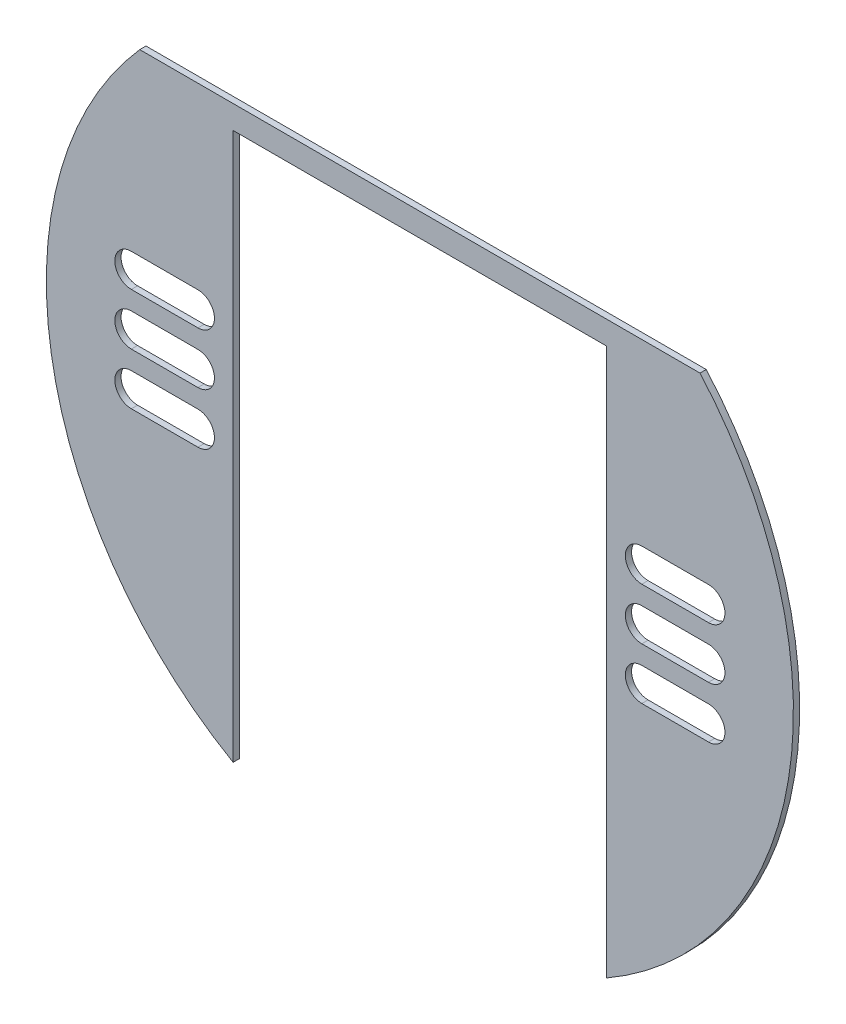
ISO-10303-21;
HEADER;
FILE_DESCRIPTION(('STEP AP214'),'2;1');
FILE_NAME('part.step','',(''),(''),'','','');
FILE_SCHEMA(('AUTOMOTIVE_DESIGN { 1 0 10303 214 1 1 1 1 }'));
ENDSEC;
DATA;
#1=APPLICATION_CONTEXT('core data for automotive mechanical design processes');
#2=APPLICATION_PROTOCOL_DEFINITION('international standard','automotive_design',2000,#1);
#3=PRODUCT_CONTEXT('',#1,'mechanical');
#4=PRODUCT('Part','Part','',(#3));
#5=PRODUCT_RELATED_PRODUCT_CATEGORY('part','',(#4));
#6=PRODUCT_DEFINITION_FORMATION('','',#4);
#7=PRODUCT_DEFINITION_CONTEXT('part definition',#1,'design');
#8=PRODUCT_DEFINITION('design','',#6,#7);
#9=PRODUCT_DEFINITION_SHAPE('','',#8);
#10=(LENGTH_UNIT() NAMED_UNIT(*) SI_UNIT(.MILLI.,.METRE.));
#11=(NAMED_UNIT(*) PLANE_ANGLE_UNIT() SI_UNIT($,.RADIAN.));
#12=(NAMED_UNIT(*) SI_UNIT($,.STERADIAN.) SOLID_ANGLE_UNIT());
#13=UNCERTAINTY_MEASURE_WITH_UNIT(LENGTH_MEASURE(1.E-05),#10,'distance_accuracy_value','');
#14=(GEOMETRIC_REPRESENTATION_CONTEXT(3) GLOBAL_UNCERTAINTY_ASSIGNED_CONTEXT((#13)) GLOBAL_UNIT_ASSIGNED_CONTEXT((#10,
#11,#12)) REPRESENTATION_CONTEXT('',''));
#15=CARTESIAN_POINT('',(0.,0.,0.));
#16=DIRECTION('',(0.,0.,1.));
#17=DIRECTION('',(1.,0.,0.));
#18=AXIS2_PLACEMENT_3D('',#15,#16,#17);
#19=CARTESIAN_POINT('',(0.,-49.0384757729337,1.));
#20=DIRECTION('',(0.,0.,-1.));
#21=DIRECTION('',(-1.,0.,0.));
#22=AXIS2_PLACEMENT_3D('',#19,#20,#21);
#23=PLANE('',#22);
#24=CARTESIAN_POINT('',(46.35,-49.0384757729337,1.));
#25=DIRECTION('',(0.,0.,1.));
#26=DIRECTION('',(1.,0.,0.));
#27=AXIS2_PLACEMENT_3D('',#24,#25,#26);
#28=CIRCLE('',#27,2.64999999999999);
#29=CARTESIAN_POINT('',(46.35,-51.6884757729337,1.));
#30=VERTEX_POINT('',#29);
#31=CARTESIAN_POINT('',(46.35,-46.3884757729337,1.));
#32=VERTEX_POINT('',#31);
#33=EDGE_CURVE('E272',#30,#32,#28,.T.);
#34=ORIENTED_EDGE('',*,*,#33,.F.);
#35=DIRECTION('',(1.,0.,0.));
#36=VECTOR('',#35,1.);
#37=CARTESIAN_POINT('',(46.35,-51.6884757729337,1.));
#38=LINE('',#37,#36);
#39=CARTESIAN_POINT('',(35.65,-51.6884757729337,1.));
#40=VERTEX_POINT('',#39);
#41=EDGE_CURVE('E280',#40,#30,#38,.T.);
#42=ORIENTED_EDGE('',*,*,#41,.F.);
#43=CARTESIAN_POINT('',(35.65,-49.0384757729337,1.));
#44=DIRECTION('',(0.,0.,1.));
#45=DIRECTION('',(1.,0.,0.));
#46=AXIS2_PLACEMENT_3D('',#43,#44,#45);
#47=CIRCLE('',#46,2.64999999999999);
#48=CARTESIAN_POINT('',(35.65,-46.3884757729337,1.));
#49=VERTEX_POINT('',#48);
#50=EDGE_CURVE('E277',#49,#40,#47,.T.);
#51=ORIENTED_EDGE('',*,*,#50,.F.);
#52=DIRECTION('',(-1.,0.,0.));
#53=VECTOR('',#52,1.);
#54=CARTESIAN_POINT('',(46.35,-46.3884757729337,1.));
#55=LINE('',#54,#53);
#56=EDGE_CURVE('E274',#32,#49,#55,.T.);
#57=ORIENTED_EDGE('',*,*,#56,.F.);
#58=EDGE_LOOP('',(#34,#42,#51,#57));
#59=FACE_BOUND('',#58,.T.);
#60=CARTESIAN_POINT('',(-35.65,-57.3384757729337,1.));
#61=DIRECTION('',(0.,0.,1.));
#62=DIRECTION('',(1.,0.,0.));
#63=AXIS2_PLACEMENT_3D('',#60,#61,#62);
#64=CIRCLE('',#63,2.65000000000001);
#65=CARTESIAN_POINT('',(-35.65,-59.9884757729337,1.));
#66=VERTEX_POINT('',#65);
#67=CARTESIAN_POINT('',(-35.65,-54.6884757729337,1.));
#68=VERTEX_POINT('',#67);
#69=EDGE_CURVE('E334',#66,#68,#64,.T.);
#70=ORIENTED_EDGE('',*,*,#69,.F.);
#71=DIRECTION('',(1.,0.,0.));
#72=VECTOR('',#71,1.);
#73=CARTESIAN_POINT('',(-35.65,-59.9884757729337,1.));
#74=LINE('',#73,#72);
#75=CARTESIAN_POINT('',(-46.35,-59.9884757729337,1.));
#76=VERTEX_POINT('',#75);
#77=EDGE_CURVE('E342',#76,#66,#74,.T.);
#78=ORIENTED_EDGE('',*,*,#77,.F.);
#79=CARTESIAN_POINT('',(-46.35,-57.3384757729337,1.));
#80=DIRECTION('',(0.,0.,1.));
#81=DIRECTION('',(1.,0.,0.));
#82=AXIS2_PLACEMENT_3D('',#79,#80,#81);
#83=CIRCLE('',#82,2.64999999999999);
#84=CARTESIAN_POINT('',(-46.35,-54.6884757729337,1.));
#85=VERTEX_POINT('',#84);
#86=EDGE_CURVE('E339',#85,#76,#83,.T.);
#87=ORIENTED_EDGE('',*,*,#86,.F.);
#88=DIRECTION('',(-1.,0.,0.));
#89=VECTOR('',#88,1.);
#90=CARTESIAN_POINT('',(-35.65,-54.6884757729337,1.));
#91=LINE('',#90,#89);
#92=EDGE_CURVE('E336',#68,#85,#91,.T.);
#93=ORIENTED_EDGE('',*,*,#92,.F.);
#94=EDGE_LOOP('',(#70,#78,#87,#93));
#95=FACE_BOUND('',#94,.T.);
#96=CARTESIAN_POINT('',(-35.65,-40.7384757729337,1.));
#97=DIRECTION('',(0.,0.,1.));
#98=DIRECTION('',(1.,0.,0.));
#99=AXIS2_PLACEMENT_3D('',#96,#97,#98);
#100=CIRCLE('',#99,2.65);
#101=CARTESIAN_POINT('',(-35.65,-43.3884757729337,1.));
#102=VERTEX_POINT('',#101);
#103=CARTESIAN_POINT('',(-35.65,-38.0884757729337,1.));
#104=VERTEX_POINT('',#103);
#105=EDGE_CURVE('E396',#102,#104,#100,.T.);
#106=ORIENTED_EDGE('',*,*,#105,.F.);
#107=DIRECTION('',(1.,0.,0.));
#108=VECTOR('',#107,1.);
#109=CARTESIAN_POINT('',(-35.65,-43.3884757729337,1.));
#110=LINE('',#109,#108);
#111=CARTESIAN_POINT('',(-46.35,-43.3884757729337,1.));
#112=VERTEX_POINT('',#111);
#113=EDGE_CURVE('E404',#112,#102,#110,.T.);
#114=ORIENTED_EDGE('',*,*,#113,.F.);
#115=CARTESIAN_POINT('',(-46.35,-40.7384757729337,1.));
#116=DIRECTION('',(0.,0.,1.));
#117=DIRECTION('',(1.,0.,0.));
#118=AXIS2_PLACEMENT_3D('',#115,#116,#117);
#119=CIRCLE('',#118,2.64999999999999);
#120=CARTESIAN_POINT('',(-46.35,-38.0884757729337,1.));
#121=VERTEX_POINT('',#120);
#122=EDGE_CURVE('E401',#121,#112,#119,.T.);
#123=ORIENTED_EDGE('',*,*,#122,.F.);
#124=DIRECTION('',(-1.,0.,0.));
#125=VECTOR('',#124,1.);
#126=CARTESIAN_POINT('',(-35.65,-38.0884757729337,1.));
#127=LINE('',#126,#125);
#128=EDGE_CURVE('E398',#104,#121,#127,.T.);
#129=ORIENTED_EDGE('',*,*,#128,.F.);
#130=EDGE_LOOP('',(#106,#114,#123,#129));
#131=FACE_BOUND('',#130,.T.);
#132=CARTESIAN_POINT('',(0.,-49.0384757729337,1.));
#133=DIRECTION('',(0.,0.,1.));
#134=DIRECTION('',(-1.,0.,0.));
#135=AXIS2_PLACEMENT_3D('',#132,#133,#134);
#136=CIRCLE('',#135,60.);
#137=CARTESIAN_POINT('',(-45.,-9.35220610696483,1.));
#138=VERTEX_POINT('',#137);
#139=CARTESIAN_POINT('',(-30.,-101.,1.));
#140=VERTEX_POINT('',#139);
#141=EDGE_CURVE('E427',#138,#140,#136,.T.);
#142=ORIENTED_EDGE('',*,*,#141,.T.);
#143=DIRECTION('',(0.,1.,0.));
#144=VECTOR('',#143,1.);
#145=CARTESIAN_POINT('',(-30.,-13.1004062070314,1.));
#146=LINE('',#145,#144);
#147=CARTESIAN_POINT('',(-30.,-13.1004062070314,1.));
#148=VERTEX_POINT('',#147);
#149=EDGE_CURVE('E430',#140,#148,#146,.T.);
#150=ORIENTED_EDGE('',*,*,#149,.T.);
#151=DIRECTION('',(1.,0.,0.));
#152=VECTOR('',#151,1.);
#153=CARTESIAN_POINT('',(-30.,-13.1004062070314,1.));
#154=LINE('',#153,#152);
#155=CARTESIAN_POINT('',(30.,-13.1004062070314,1.));
#156=VERTEX_POINT('',#155);
#157=EDGE_CURVE('E433',#148,#156,#154,.T.);
#158=ORIENTED_EDGE('',*,*,#157,.T.);
#159=DIRECTION('',(0.,-1.,0.));
#160=VECTOR('',#159,1.);
#161=CARTESIAN_POINT('',(30.,-101.,1.));
#162=LINE('',#161,#160);
#163=CARTESIAN_POINT('',(30.,-101.,1.));
#164=VERTEX_POINT('',#163);
#165=EDGE_CURVE('E435',#156,#164,#162,.T.);
#166=ORIENTED_EDGE('',*,*,#165,.T.);
#167=CARTESIAN_POINT('',(0.,-49.0384757729337,1.));
#168=DIRECTION('',(0.,0.,1.));
#169=DIRECTION('',(-1.,0.,0.));
#170=AXIS2_PLACEMENT_3D('',#167,#168,#169);
#171=CIRCLE('',#170,60.);
#172=CARTESIAN_POINT('',(45.,-9.35220610696484,1.));
#173=VERTEX_POINT('',#172);
#174=EDGE_CURVE('E437',#164,#173,#171,.T.);
#175=ORIENTED_EDGE('',*,*,#174,.T.);
#176=DIRECTION('',(-1.,0.,0.));
#177=VECTOR('',#176,1.);
#178=CARTESIAN_POINT('',(-45.,-9.35220610696483,1.));
#179=LINE('',#178,#177);
#180=EDGE_CURVE('E439',#173,#138,#179,.T.);
#181=ORIENTED_EDGE('',*,*,#180,.T.);
#182=EDGE_LOOP('',(#142,#150,#158,#166,#175,#181));
#183=FACE_BOUND('',#182,.T.);
#184=CARTESIAN_POINT('',(-35.65,-49.0384757729337,1.));
#185=DIRECTION('',(0.,0.,1.));
#186=DIRECTION('',(1.,0.,0.));
#187=AXIS2_PLACEMENT_3D('',#184,#185,#186);
#188=CIRCLE('',#187,2.64999999999999);
#189=CARTESIAN_POINT('',(-35.65,-51.6884757729337,1.));
#190=VERTEX_POINT('',#189);
#191=CARTESIAN_POINT('',(-35.65,-46.3884757729337,1.));
#192=VERTEX_POINT('',#191);
#193=EDGE_CURVE('E365',#190,#192,#188,.T.);
#194=ORIENTED_EDGE('',*,*,#193,.F.);
#195=DIRECTION('',(1.,0.,0.));
#196=VECTOR('',#195,1.);
#197=CARTESIAN_POINT('',(-35.65,-51.6884757729337,1.));
#198=LINE('',#197,#196);
#199=CARTESIAN_POINT('',(-46.35,-51.6884757729337,1.));
#200=VERTEX_POINT('',#199);
#201=EDGE_CURVE('E373',#200,#190,#198,.T.);
#202=ORIENTED_EDGE('',*,*,#201,.F.);
#203=CARTESIAN_POINT('',(-46.35,-49.0384757729337,1.));
#204=DIRECTION('',(0.,0.,1.));
#205=DIRECTION('',(1.,0.,0.));
#206=AXIS2_PLACEMENT_3D('',#203,#204,#205);
#207=CIRCLE('',#206,2.64999999999999);
#208=CARTESIAN_POINT('',(-46.35,-46.3884757729337,1.));
#209=VERTEX_POINT('',#208);
#210=EDGE_CURVE('E370',#209,#200,#207,.T.);
#211=ORIENTED_EDGE('',*,*,#210,.F.);
#212=DIRECTION('',(-1.,0.,0.));
#213=VECTOR('',#212,1.);
#214=CARTESIAN_POINT('',(-35.65,-46.3884757729337,1.));
#215=LINE('',#214,#213);
#216=EDGE_CURVE('E367',#192,#209,#215,.T.);
#217=ORIENTED_EDGE('',*,*,#216,.F.);
#218=EDGE_LOOP('',(#194,#202,#211,#217));
#219=FACE_BOUND('',#218,.T.);
#220=CARTESIAN_POINT('',(46.35,-40.7384757729337,1.));
#221=DIRECTION('',(0.,0.,1.));
#222=DIRECTION('',(1.,0.,0.));
#223=AXIS2_PLACEMENT_3D('',#220,#221,#222);
#224=CIRCLE('',#223,2.64999999999999);
#225=CARTESIAN_POINT('',(46.35,-43.3884757729337,1.));
#226=VERTEX_POINT('',#225);
#227=CARTESIAN_POINT('',(46.35,-38.0884757729337,1.));
#228=VERTEX_POINT('',#227);
#229=EDGE_CURVE('E303',#226,#228,#224,.T.);
#230=ORIENTED_EDGE('',*,*,#229,.F.);
#231=DIRECTION('',(1.,0.,0.));
#232=VECTOR('',#231,1.);
#233=CARTESIAN_POINT('',(46.35,-43.3884757729337,1.));
#234=LINE('',#233,#232);
#235=CARTESIAN_POINT('',(35.65,-43.3884757729337,1.));
#236=VERTEX_POINT('',#235);
#237=EDGE_CURVE('E311',#236,#226,#234,.T.);
#238=ORIENTED_EDGE('',*,*,#237,.F.);
#239=CARTESIAN_POINT('',(35.65,-40.7384757729337,1.));
#240=DIRECTION('',(0.,0.,1.));
#241=DIRECTION('',(1.,0.,0.));
#242=AXIS2_PLACEMENT_3D('',#239,#240,#241);
#243=CIRCLE('',#242,2.64999999999999);
#244=CARTESIAN_POINT('',(35.65,-38.0884757729337,1.));
#245=VERTEX_POINT('',#244);
#246=EDGE_CURVE('E308',#245,#236,#243,.T.);
#247=ORIENTED_EDGE('',*,*,#246,.F.);
#248=DIRECTION('',(-1.,0.,0.));
#249=VECTOR('',#248,1.);
#250=CARTESIAN_POINT('',(46.35,-38.0884757729337,1.));
#251=LINE('',#250,#249);
#252=EDGE_CURVE('E305',#228,#245,#251,.T.);
#253=ORIENTED_EDGE('',*,*,#252,.F.);
#254=EDGE_LOOP('',(#230,#238,#247,#253));
#255=FACE_BOUND('',#254,.T.);
#256=CARTESIAN_POINT('',(46.35,-57.3384757729337,1.));
#257=DIRECTION('',(0.,0.,1.));
#258=DIRECTION('',(1.,0.,0.));
#259=AXIS2_PLACEMENT_3D('',#256,#257,#258);
#260=CIRCLE('',#259,2.65);
#261=CARTESIAN_POINT('',(46.35,-59.9884757729337,1.));
#262=VERTEX_POINT('',#261);
#263=CARTESIAN_POINT('',(46.35,-54.6884757729337,1.));
#264=VERTEX_POINT('',#263);
#265=EDGE_CURVE('E236',#262,#264,#260,.T.);
#266=ORIENTED_EDGE('',*,*,#265,.F.);
#267=DIRECTION('',(1.,0.,0.));
#268=VECTOR('',#267,1.);
#269=CARTESIAN_POINT('',(46.35,-59.9884757729337,1.));
#270=LINE('',#269,#268);
#271=CARTESIAN_POINT('',(35.65,-59.9884757729337,1.));
#272=VERTEX_POINT('',#271);
#273=EDGE_CURVE('E258',#272,#262,#270,.T.);
#274=ORIENTED_EDGE('',*,*,#273,.F.);
#275=CARTESIAN_POINT('',(35.65,-57.3384757729337,1.));
#276=DIRECTION('',(0.,0.,1.));
#277=DIRECTION('',(1.,0.,0.));
#278=AXIS2_PLACEMENT_3D('',#275,#276,#277);
#279=CIRCLE('',#278,2.65000000000001);
#280=CARTESIAN_POINT('',(35.65,-54.6884757729337,1.));
#281=VERTEX_POINT('',#280);
#282=EDGE_CURVE('E256',#281,#272,#279,.T.);
#283=ORIENTED_EDGE('',*,*,#282,.F.);
#284=DIRECTION('',(-1.,0.,0.));
#285=VECTOR('',#284,1.);
#286=CARTESIAN_POINT('',(46.35,-54.6884757729337,1.));
#287=LINE('',#286,#285);
#288=EDGE_CURVE('E244',#264,#281,#287,.T.);
#289=ORIENTED_EDGE('',*,*,#288,.F.);
#290=EDGE_LOOP('',(#266,#274,#283,#289));
#291=FACE_BOUND('',#290,.T.);
#292=ADVANCED_FACE('F39',(#59,#95,#131,#183,#219,#255,#291),#23,.F.);
#293=CARTESIAN_POINT('',(0.,-49.0384757729337,0.));
#294=DIRECTION('',(0.,0.,-1.));
#295=DIRECTION('',(-1.,0.,0.));
#296=AXIS2_PLACEMENT_3D('',#293,#294,#295);
#297=PLANE('',#296);
#298=CARTESIAN_POINT('',(0.,-49.0384757729337,0.));
#299=DIRECTION('',(0.,0.,1.));
#300=DIRECTION('',(-1.,0.,0.));
#301=AXIS2_PLACEMENT_3D('',#298,#299,#300);
#302=CIRCLE('',#301,60.);
#303=CARTESIAN_POINT('',(-45.,-9.35220610696483,0.));
#304=VERTEX_POINT('',#303);
#305=CARTESIAN_POINT('',(-30.,-101.,0.));
#306=VERTEX_POINT('',#305);
#307=EDGE_CURVE('E426',#304,#306,#302,.T.);
#308=ORIENTED_EDGE('',*,*,#307,.F.);
#309=DIRECTION('',(-1.,0.,0.));
#310=VECTOR('',#309,1.);
#311=CARTESIAN_POINT('',(-45.,-9.35220610696483,0.));
#312=LINE('',#311,#310);
#313=CARTESIAN_POINT('',(45.,-9.35220610696484,0.));
#314=VERTEX_POINT('',#313);
#315=EDGE_CURVE('E431',#314,#304,#312,.T.);
#316=ORIENTED_EDGE('',*,*,#315,.F.);
#317=CARTESIAN_POINT('',(0.,-49.0384757729337,0.));
#318=DIRECTION('',(0.,0.,1.));
#319=DIRECTION('',(-1.,0.,0.));
#320=AXIS2_PLACEMENT_3D('',#317,#318,#319);
#321=CIRCLE('',#320,60.);
#322=CARTESIAN_POINT('',(30.,-101.,0.));
#323=VERTEX_POINT('',#322);
#324=EDGE_CURVE('E450',#323,#314,#321,.T.);
#325=ORIENTED_EDGE('',*,*,#324,.F.);
#326=DIRECTION('',(0.,-1.,0.));
#327=VECTOR('',#326,1.);
#328=CARTESIAN_POINT('',(30.,-101.,0.));
#329=LINE('',#328,#327);
#330=CARTESIAN_POINT('',(30.,-13.1004062070314,0.));
#331=VERTEX_POINT('',#330);
#332=EDGE_CURVE('E448',#331,#323,#329,.T.);
#333=ORIENTED_EDGE('',*,*,#332,.F.);
#334=DIRECTION('',(1.,0.,0.));
#335=VECTOR('',#334,1.);
#336=CARTESIAN_POINT('',(-30.,-13.1004062070314,0.));
#337=LINE('',#336,#335);
#338=CARTESIAN_POINT('',(-30.,-13.1004062070314,0.));
#339=VERTEX_POINT('',#338);
#340=EDGE_CURVE('E446',#339,#331,#337,.T.);
#341=ORIENTED_EDGE('',*,*,#340,.F.);
#342=DIRECTION('',(0.,1.,0.));
#343=VECTOR('',#342,1.);
#344=CARTESIAN_POINT('',(-30.,-13.1004062070314,0.));
#345=LINE('',#344,#343);
#346=EDGE_CURVE('E444',#306,#339,#345,.T.);
#347=ORIENTED_EDGE('',*,*,#346,.F.);
#348=EDGE_LOOP('',(#308,#316,#325,#333,#341,#347));
#349=FACE_BOUND('',#348,.T.);
#350=DIRECTION('',(1.,0.,0.));
#351=VECTOR('',#350,1.);
#352=CARTESIAN_POINT('',(-35.65,-43.3884757729337,0.));
#353=LINE('',#352,#351);
#354=CARTESIAN_POINT('',(-46.35,-43.3884757729337,0.));
#355=VERTEX_POINT('',#354);
#356=CARTESIAN_POINT('',(-35.65,-43.3884757729337,0.));
#357=VERTEX_POINT('',#356);
#358=EDGE_CURVE('E399',#355,#357,#353,.T.);
#359=ORIENTED_EDGE('',*,*,#358,.T.);
#360=CARTESIAN_POINT('',(-35.65,-40.7384757729337,0.));
#361=DIRECTION('',(0.,0.,1.));
#362=DIRECTION('',(1.,0.,0.));
#363=AXIS2_PLACEMENT_3D('',#360,#361,#362);
#364=CIRCLE('',#363,2.65);
#365=CARTESIAN_POINT('',(-35.65,-38.0884757729337,0.));
#366=VERTEX_POINT('',#365);
#367=EDGE_CURVE('E395',#357,#366,#364,.T.);
#368=ORIENTED_EDGE('',*,*,#367,.T.);
#369=DIRECTION('',(-1.,0.,0.));
#370=VECTOR('',#369,1.);
#371=CARTESIAN_POINT('',(-35.65,-38.0884757729337,0.));
#372=LINE('',#371,#370);
#373=CARTESIAN_POINT('',(-46.35,-38.0884757729337,0.));
#374=VERTEX_POINT('',#373);
#375=EDGE_CURVE('E409',#366,#374,#372,.T.);
#376=ORIENTED_EDGE('',*,*,#375,.T.);
#377=CARTESIAN_POINT('',(-46.35,-40.7384757729337,0.));
#378=DIRECTION('',(0.,0.,1.));
#379=DIRECTION('',(1.,0.,0.));
#380=AXIS2_PLACEMENT_3D('',#377,#378,#379);
#381=CIRCLE('',#380,2.64999999999999);
#382=EDGE_CURVE('E412',#374,#355,#381,.T.);
#383=ORIENTED_EDGE('',*,*,#382,.T.);
#384=EDGE_LOOP('',(#359,#368,#376,#383));
#385=FACE_BOUND('',#384,.T.);
#386=DIRECTION('',(1.,0.,0.));
#387=VECTOR('',#386,1.);
#388=CARTESIAN_POINT('',(-35.65,-51.6884757729337,0.));
#389=LINE('',#388,#387);
#390=CARTESIAN_POINT('',(-46.35,-51.6884757729337,0.));
#391=VERTEX_POINT('',#390);
#392=CARTESIAN_POINT('',(-35.65,-51.6884757729337,0.));
#393=VERTEX_POINT('',#392);
#394=EDGE_CURVE('E368',#391,#393,#389,.T.);
#395=ORIENTED_EDGE('',*,*,#394,.T.);
#396=CARTESIAN_POINT('',(-35.65,-49.0384757729337,0.));
#397=DIRECTION('',(0.,0.,1.));
#398=DIRECTION('',(1.,0.,0.));
#399=AXIS2_PLACEMENT_3D('',#396,#397,#398);
#400=CIRCLE('',#399,2.64999999999999);
#401=CARTESIAN_POINT('',(-35.65,-46.3884757729337,0.));
#402=VERTEX_POINT('',#401);
#403=EDGE_CURVE('E364',#393,#402,#400,.T.);
#404=ORIENTED_EDGE('',*,*,#403,.T.);
#405=DIRECTION('',(-1.,0.,0.));
#406=VECTOR('',#405,1.);
#407=CARTESIAN_POINT('',(-35.65,-46.3884757729337,0.));
#408=LINE('',#407,#406);
#409=CARTESIAN_POINT('',(-46.35,-46.3884757729337,0.));
#410=VERTEX_POINT('',#409);
#411=EDGE_CURVE('E378',#402,#410,#408,.T.);
#412=ORIENTED_EDGE('',*,*,#411,.T.);
#413=CARTESIAN_POINT('',(-46.35,-49.0384757729337,0.));
#414=DIRECTION('',(0.,0.,1.));
#415=DIRECTION('',(1.,0.,0.));
#416=AXIS2_PLACEMENT_3D('',#413,#414,#415);
#417=CIRCLE('',#416,2.64999999999999);
#418=EDGE_CURVE('E381',#410,#391,#417,.T.);
#419=ORIENTED_EDGE('',*,*,#418,.T.);
#420=EDGE_LOOP('',(#395,#404,#412,#419));
#421=FACE_BOUND('',#420,.T.);
#422=DIRECTION('',(1.,0.,0.));
#423=VECTOR('',#422,1.);
#424=CARTESIAN_POINT('',(-35.65,-59.9884757729337,0.));
#425=LINE('',#424,#423);
#426=CARTESIAN_POINT('',(-46.35,-59.9884757729337,0.));
#427=VERTEX_POINT('',#426);
#428=CARTESIAN_POINT('',(-35.65,-59.9884757729337,0.));
#429=VERTEX_POINT('',#428);
#430=EDGE_CURVE('E337',#427,#429,#425,.T.);
#431=ORIENTED_EDGE('',*,*,#430,.T.);
#432=CARTESIAN_POINT('',(-35.65,-57.3384757729337,0.));
#433=DIRECTION('',(0.,0.,1.));
#434=DIRECTION('',(1.,0.,0.));
#435=AXIS2_PLACEMENT_3D('',#432,#433,#434);
#436=CIRCLE('',#435,2.65000000000001);
#437=CARTESIAN_POINT('',(-35.65,-54.6884757729337,0.));
#438=VERTEX_POINT('',#437);
#439=EDGE_CURVE('E333',#429,#438,#436,.T.);
#440=ORIENTED_EDGE('',*,*,#439,.T.);
#441=DIRECTION('',(-1.,0.,0.));
#442=VECTOR('',#441,1.);
#443=CARTESIAN_POINT('',(-35.65,-54.6884757729337,0.));
#444=LINE('',#443,#442);
#445=CARTESIAN_POINT('',(-46.35,-54.6884757729337,0.));
#446=VERTEX_POINT('',#445);
#447=EDGE_CURVE('E347',#438,#446,#444,.T.);
#448=ORIENTED_EDGE('',*,*,#447,.T.);
#449=CARTESIAN_POINT('',(-46.35,-57.3384757729337,0.));
#450=DIRECTION('',(0.,0.,1.));
#451=DIRECTION('',(1.,0.,0.));
#452=AXIS2_PLACEMENT_3D('',#449,#450,#451);
#453=CIRCLE('',#452,2.64999999999999);
#454=EDGE_CURVE('E350',#446,#427,#453,.T.);
#455=ORIENTED_EDGE('',*,*,#454,.T.);
#456=EDGE_LOOP('',(#431,#440,#448,#455));
#457=FACE_BOUND('',#456,.T.);
#458=DIRECTION('',(1.,0.,0.));
#459=VECTOR('',#458,1.);
#460=CARTESIAN_POINT('',(46.35,-43.3884757729337,0.));
#461=LINE('',#460,#459);
#462=CARTESIAN_POINT('',(35.65,-43.3884757729337,0.));
#463=VERTEX_POINT('',#462);
#464=CARTESIAN_POINT('',(46.35,-43.3884757729337,0.));
#465=VERTEX_POINT('',#464);
#466=EDGE_CURVE('E306',#463,#465,#461,.T.);
#467=ORIENTED_EDGE('',*,*,#466,.T.);
#468=CARTESIAN_POINT('',(46.35,-40.7384757729337,0.));
#469=DIRECTION('',(0.,0.,1.));
#470=DIRECTION('',(1.,0.,0.));
#471=AXIS2_PLACEMENT_3D('',#468,#469,#470);
#472=CIRCLE('',#471,2.64999999999999);
#473=CARTESIAN_POINT('',(46.35,-38.0884757729337,0.));
#474=VERTEX_POINT('',#473);
#475=EDGE_CURVE('E302',#465,#474,#472,.T.);
#476=ORIENTED_EDGE('',*,*,#475,.T.);
#477=DIRECTION('',(-1.,0.,0.));
#478=VECTOR('',#477,1.);
#479=CARTESIAN_POINT('',(46.35,-38.0884757729337,0.));
#480=LINE('',#479,#478);
#481=CARTESIAN_POINT('',(35.65,-38.0884757729337,0.));
#482=VERTEX_POINT('',#481);
#483=EDGE_CURVE('E316',#474,#482,#480,.T.);
#484=ORIENTED_EDGE('',*,*,#483,.T.);
#485=CARTESIAN_POINT('',(35.65,-40.7384757729337,0.));
#486=DIRECTION('',(0.,0.,1.));
#487=DIRECTION('',(1.,0.,0.));
#488=AXIS2_PLACEMENT_3D('',#485,#486,#487);
#489=CIRCLE('',#488,2.64999999999999);
#490=EDGE_CURVE('E319',#482,#463,#489,.T.);
#491=ORIENTED_EDGE('',*,*,#490,.T.);
#492=EDGE_LOOP('',(#467,#476,#484,#491));
#493=FACE_BOUND('',#492,.T.);
#494=DIRECTION('',(1.,0.,0.));
#495=VECTOR('',#494,1.);
#496=CARTESIAN_POINT('',(46.35,-51.6884757729337,0.));
#497=LINE('',#496,#495);
#498=CARTESIAN_POINT('',(35.65,-51.6884757729337,0.));
#499=VERTEX_POINT('',#498);
#500=CARTESIAN_POINT('',(46.35,-51.6884757729337,0.));
#501=VERTEX_POINT('',#500);
#502=EDGE_CURVE('E275',#499,#501,#497,.T.);
#503=ORIENTED_EDGE('',*,*,#502,.T.);
#504=CARTESIAN_POINT('',(46.35,-49.0384757729337,0.));
#505=DIRECTION('',(0.,0.,1.));
#506=DIRECTION('',(1.,0.,0.));
#507=AXIS2_PLACEMENT_3D('',#504,#505,#506);
#508=CIRCLE('',#507,2.64999999999999);
#509=CARTESIAN_POINT('',(46.35,-46.3884757729337,0.));
#510=VERTEX_POINT('',#509);
#511=EDGE_CURVE('E252',#501,#510,#508,.T.);
#512=ORIENTED_EDGE('',*,*,#511,.T.);
#513=DIRECTION('',(-1.,0.,0.));
#514=VECTOR('',#513,1.);
#515=CARTESIAN_POINT('',(46.35,-46.3884757729337,0.));
#516=LINE('',#515,#514);
#517=CARTESIAN_POINT('',(35.65,-46.3884757729337,0.));
#518=VERTEX_POINT('',#517);
#519=EDGE_CURVE('E285',#510,#518,#516,.T.);
#520=ORIENTED_EDGE('',*,*,#519,.T.);
#521=CARTESIAN_POINT('',(35.65,-49.0384757729337,0.));
#522=DIRECTION('',(0.,0.,1.));
#523=DIRECTION('',(1.,0.,0.));
#524=AXIS2_PLACEMENT_3D('',#521,#522,#523);
#525=CIRCLE('',#524,2.64999999999999);
#526=EDGE_CURVE('E288',#518,#499,#525,.T.);
#527=ORIENTED_EDGE('',*,*,#526,.T.);
#528=EDGE_LOOP('',(#503,#512,#520,#527));
#529=FACE_BOUND('',#528,.T.);
#530=DIRECTION('',(1.,0.,0.));
#531=VECTOR('',#530,1.);
#532=CARTESIAN_POINT('',(46.35,-59.9884757729337,0.));
#533=LINE('',#532,#531);
#534=CARTESIAN_POINT('',(35.65,-59.9884757729337,0.));
#535=VERTEX_POINT('',#534);
#536=CARTESIAN_POINT('',(46.35,-59.9884757729337,0.));
#537=VERTEX_POINT('',#536);
#538=EDGE_CURVE('E245',#535,#537,#533,.T.);
#539=ORIENTED_EDGE('',*,*,#538,.T.);
#540=CARTESIAN_POINT('',(46.35,-57.3384757729337,0.));
#541=DIRECTION('',(0.,0.,1.));
#542=DIRECTION('',(1.,0.,0.));
#543=AXIS2_PLACEMENT_3D('',#540,#541,#542);
#544=CIRCLE('',#543,2.65);
#545=CARTESIAN_POINT('',(46.35,-54.6884757729337,0.));
#546=VERTEX_POINT('',#545);
#547=EDGE_CURVE('E62',#537,#546,#544,.T.);
#548=ORIENTED_EDGE('',*,*,#547,.T.);
#549=DIRECTION('',(-1.,0.,0.));
#550=VECTOR('',#549,1.);
#551=CARTESIAN_POINT('',(46.35,-54.6884757729337,0.));
#552=LINE('',#551,#550);
#553=CARTESIAN_POINT('',(35.65,-54.6884757729337,0.));
#554=VERTEX_POINT('',#553);
#555=EDGE_CURVE('E251',#546,#554,#552,.T.);
#556=ORIENTED_EDGE('',*,*,#555,.T.);
#557=CARTESIAN_POINT('',(35.65,-57.3384757729337,0.));
#558=DIRECTION('',(0.,0.,1.));
#559=DIRECTION('',(1.,0.,0.));
#560=AXIS2_PLACEMENT_3D('',#557,#558,#559);
#561=CIRCLE('',#560,2.65000000000001);
#562=EDGE_CURVE('E264',#554,#535,#561,.T.);
#563=ORIENTED_EDGE('',*,*,#562,.T.);
#564=EDGE_LOOP('',(#539,#548,#556,#563));
#565=FACE_BOUND('',#564,.T.);
#566=ADVANCED_FACE('F474',(#349,#385,#421,#457,#493,#529,#565),#297,.T.);
#567=CARTESIAN_POINT('',(0.,-49.0384757729337,1.));
#568=DIRECTION('',(0.,0.,-1.));
#569=DIRECTION('',(-1.,0.,0.));
#570=AXIS2_PLACEMENT_3D('',#567,#568,#569);
#571=CYLINDRICAL_SURFACE('',#570,60.);
#572=ORIENTED_EDGE('',*,*,#307,.T.);
#573=DIRECTION('',(0.,0.,-1.));
#574=VECTOR('',#573,1.);
#575=CARTESIAN_POINT('',(-30.,-101.,1.));
#576=LINE('',#575,#574);
#577=EDGE_CURVE('E11',#140,#306,#576,.T.);
#578=ORIENTED_EDGE('',*,*,#577,.F.);
#579=ORIENTED_EDGE('',*,*,#141,.F.);
#580=DIRECTION('',(0.,0.,-1.));
#581=VECTOR('',#580,1.);
#582=CARTESIAN_POINT('',(-45.,-9.35220610696483,1.));
#583=LINE('',#582,#581);
#584=EDGE_CURVE('E441',#138,#304,#583,.T.);
#585=ORIENTED_EDGE('',*,*,#584,.T.);
#586=EDGE_LOOP('',(#572,#578,#579,#585));
#587=FACE_BOUND('',#586,.T.);
#588=ADVANCED_FACE('F41',(#587),#571,.T.);
#589=CARTESIAN_POINT('',(-30.,-13.1004062070314,1.));
#590=DIRECTION('',(-1.,0.,0.));
#591=DIRECTION('',(0.,-1.,0.));
#592=AXIS2_PLACEMENT_3D('',#589,#590,#591);
#593=PLANE('',#592);
#594=ORIENTED_EDGE('',*,*,#346,.T.);
#595=DIRECTION('',(0.,0.,-1.));
#596=VECTOR('',#595,1.);
#597=CARTESIAN_POINT('',(-30.,-13.1004062070314,1.));
#598=LINE('',#597,#596);
#599=EDGE_CURVE('E47',#148,#339,#598,.T.);
#600=ORIENTED_EDGE('',*,*,#599,.F.);
#601=ORIENTED_EDGE('',*,*,#149,.F.);
#602=ORIENTED_EDGE('',*,*,#577,.T.);
#603=EDGE_LOOP('',(#594,#600,#601,#602));
#604=FACE_BOUND('',#603,.T.);
#605=ADVANCED_FACE('F492',(#604),#593,.F.);
#606=CARTESIAN_POINT('',(-30.,-13.1004062070314,1.));
#607=DIRECTION('',(0.,1.,0.));
#608=DIRECTION('',(0.,0.,1.));
#609=AXIS2_PLACEMENT_3D('',#606,#607,#608);
#610=PLANE('',#609);
#611=ORIENTED_EDGE('',*,*,#340,.T.);
#612=DIRECTION('',(0.,0.,-1.));
#613=VECTOR('',#612,1.);
#614=CARTESIAN_POINT('',(30.,-13.1004062070314,1.));
#615=LINE('',#614,#613);
#616=EDGE_CURVE('E461',#156,#331,#615,.T.);
#617=ORIENTED_EDGE('',*,*,#616,.F.);
#618=ORIENTED_EDGE('',*,*,#157,.F.);
#619=ORIENTED_EDGE('',*,*,#599,.T.);
#620=EDGE_LOOP('',(#611,#617,#618,#619));
#621=FACE_BOUND('',#620,.T.);
#622=ADVANCED_FACE('F468',(#621),#610,.F.);
#623=CARTESIAN_POINT('',(30.,-101.,1.));
#624=DIRECTION('',(1.,0.,0.));
#625=DIRECTION('',(0.,1.,0.));
#626=AXIS2_PLACEMENT_3D('',#623,#624,#625);
#627=PLANE('',#626);
#628=ORIENTED_EDGE('',*,*,#332,.T.);
#629=DIRECTION('',(0.,0.,-1.));
#630=VECTOR('',#629,1.);
#631=CARTESIAN_POINT('',(30.,-101.,1.));
#632=LINE('',#631,#630);
#633=EDGE_CURVE('E458',#164,#323,#632,.T.);
#634=ORIENTED_EDGE('',*,*,#633,.F.);
#635=ORIENTED_EDGE('',*,*,#165,.F.);
#636=ORIENTED_EDGE('',*,*,#616,.T.);
#637=EDGE_LOOP('',(#628,#634,#635,#636));
#638=FACE_BOUND('',#637,.T.);
#639=ADVANCED_FACE('F480',(#638),#627,.F.);
#640=CARTESIAN_POINT('',(0.,-49.0384757729337,1.));
#641=DIRECTION('',(0.,0.,-1.));
#642=DIRECTION('',(-1.,0.,0.));
#643=AXIS2_PLACEMENT_3D('',#640,#641,#642);
#644=CYLINDRICAL_SURFACE('',#643,60.);
#645=ORIENTED_EDGE('',*,*,#324,.T.);
#646=DIRECTION('',(0.,0.,-1.));
#647=VECTOR('',#646,1.);
#648=CARTESIAN_POINT('',(45.,-9.35220610696484,1.));
#649=LINE('',#648,#647);
#650=EDGE_CURVE('E455',#173,#314,#649,.T.);
#651=ORIENTED_EDGE('',*,*,#650,.F.);
#652=ORIENTED_EDGE('',*,*,#174,.F.);
#653=ORIENTED_EDGE('',*,*,#633,.T.);
#654=EDGE_LOOP('',(#645,#651,#652,#653));
#655=FACE_BOUND('',#654,.T.);
#656=ADVANCED_FACE('F484',(#655),#644,.T.);
#657=CARTESIAN_POINT('',(-45.,-9.35220610696483,1.));
#658=DIRECTION('',(0.,-1.,0.));
#659=DIRECTION('',(0.,0.,-1.));
#660=AXIS2_PLACEMENT_3D('',#657,#658,#659);
#661=PLANE('',#660);
#662=ORIENTED_EDGE('',*,*,#315,.T.);
#663=ORIENTED_EDGE('',*,*,#584,.F.);
#664=ORIENTED_EDGE('',*,*,#180,.F.);
#665=ORIENTED_EDGE('',*,*,#650,.T.);
#666=EDGE_LOOP('',(#662,#663,#664,#665));
#667=FACE_BOUND('',#666,.T.);
#668=ADVANCED_FACE('F495',(#667),#661,.F.);
#669=CARTESIAN_POINT('',(-35.65,-40.7384757729337,1.));
#670=DIRECTION('',(0.,0.,-1.));
#671=DIRECTION('',(-1.,0.,0.));
#672=AXIS2_PLACEMENT_3D('',#669,#670,#671);
#673=CYLINDRICAL_SURFACE('',#672,2.65);
#674=ORIENTED_EDGE('',*,*,#367,.F.);
#675=DIRECTION('',(0.,0.,-1.));
#676=VECTOR('',#675,1.);
#677=CARTESIAN_POINT('',(-35.65,-43.3884757729337,1.));
#678=LINE('',#677,#676);
#679=EDGE_CURVE('E406',#102,#357,#678,.T.);
#680=ORIENTED_EDGE('',*,*,#679,.F.);
#681=ORIENTED_EDGE('',*,*,#105,.T.);
#682=DIRECTION('',(0.,0.,-1.));
#683=VECTOR('',#682,1.);
#684=CARTESIAN_POINT('',(-35.65,-38.0884757729337,1.));
#685=LINE('',#684,#683);
#686=EDGE_CURVE('E423',#104,#366,#685,.T.);
#687=ORIENTED_EDGE('',*,*,#686,.T.);
#688=EDGE_LOOP('',(#674,#680,#681,#687));
#689=FACE_BOUND('',#688,.T.);
#690=ADVANCED_FACE('F497',(#689),#673,.F.);
#691=CARTESIAN_POINT('',(-35.65,-38.0884757729337,1.));
#692=DIRECTION('',(0.,-1.,0.));
#693=DIRECTION('',(1.,0.,0.));
#694=AXIS2_PLACEMENT_3D('',#691,#692,#693);
#695=PLANE('',#694);
#696=ORIENTED_EDGE('',*,*,#375,.F.);
#697=ORIENTED_EDGE('',*,*,#686,.F.);
#698=ORIENTED_EDGE('',*,*,#128,.T.);
#699=DIRECTION('',(0.,0.,-1.));
#700=VECTOR('',#699,1.);
#701=CARTESIAN_POINT('',(-46.35,-38.0884757729337,1.));
#702=LINE('',#701,#700);
#703=EDGE_CURVE('E421',#121,#374,#702,.T.);
#704=ORIENTED_EDGE('',*,*,#703,.T.);
#705=EDGE_LOOP('',(#696,#697,#698,#704));
#706=FACE_BOUND('',#705,.T.);
#707=ADVANCED_FACE('F503',(#706),#695,.T.);
#708=CARTESIAN_POINT('',(-46.35,-40.7384757729337,1.));
#709=DIRECTION('',(0.,0.,-1.));
#710=DIRECTION('',(-1.,0.,0.));
#711=AXIS2_PLACEMENT_3D('',#708,#709,#710);
#712=CYLINDRICAL_SURFACE('',#711,2.64999999999999);
#713=ORIENTED_EDGE('',*,*,#382,.F.);
#714=ORIENTED_EDGE('',*,*,#703,.F.);
#715=ORIENTED_EDGE('',*,*,#122,.T.);
#716=DIRECTION('',(0.,0.,-1.));
#717=VECTOR('',#716,1.);
#718=CARTESIAN_POINT('',(-46.35,-43.3884757729337,1.));
#719=LINE('',#718,#717);
#720=EDGE_CURVE('E419',#112,#355,#719,.T.);
#721=ORIENTED_EDGE('',*,*,#720,.T.);
#722=EDGE_LOOP('',(#713,#714,#715,#721));
#723=FACE_BOUND('',#722,.T.);
#724=ADVANCED_FACE('F519',(#723),#712,.F.);
#725=CARTESIAN_POINT('',(-35.65,-43.3884757729337,1.));
#726=DIRECTION('',(0.,1.,0.));
#727=DIRECTION('',(-1.,0.,0.));
#728=AXIS2_PLACEMENT_3D('',#725,#726,#727);
#729=PLANE('',#728);
#730=ORIENTED_EDGE('',*,*,#358,.F.);
#731=ORIENTED_EDGE('',*,*,#720,.F.);
#732=ORIENTED_EDGE('',*,*,#113,.T.);
#733=ORIENTED_EDGE('',*,*,#679,.T.);
#734=EDGE_LOOP('',(#730,#731,#732,#733));
#735=FACE_BOUND('',#734,.T.);
#736=ADVANCED_FACE('F523',(#735),#729,.T.);
#737=CARTESIAN_POINT('',(-35.65,-49.0384757729337,1.));
#738=DIRECTION('',(0.,0.,-1.));
#739=DIRECTION('',(-1.,0.,0.));
#740=AXIS2_PLACEMENT_3D('',#737,#738,#739);
#741=CYLINDRICAL_SURFACE('',#740,2.64999999999999);
#742=ORIENTED_EDGE('',*,*,#403,.F.);
#743=DIRECTION('',(0.,0.,-1.));
#744=VECTOR('',#743,1.);
#745=CARTESIAN_POINT('',(-35.65,-51.6884757729337,1.));
#746=LINE('',#745,#744);
#747=EDGE_CURVE('E375',#190,#393,#746,.T.);
#748=ORIENTED_EDGE('',*,*,#747,.F.);
#749=ORIENTED_EDGE('',*,*,#193,.T.);
#750=DIRECTION('',(0.,0.,-1.));
#751=VECTOR('',#750,1.);
#752=CARTESIAN_POINT('',(-35.65,-46.3884757729337,1.));
#753=LINE('',#752,#751);
#754=EDGE_CURVE('E392',#192,#402,#753,.T.);
#755=ORIENTED_EDGE('',*,*,#754,.T.);
#756=EDGE_LOOP('',(#742,#748,#749,#755));
#757=FACE_BOUND('',#756,.T.);
#758=ADVANCED_FACE('F527',(#757),#741,.F.);
#759=CARTESIAN_POINT('',(-35.65,-46.3884757729337,1.));
#760=DIRECTION('',(0.,-1.,0.));
#761=DIRECTION('',(0.,0.,-1.));
#762=AXIS2_PLACEMENT_3D('',#759,#760,#761);
#763=PLANE('',#762);
#764=ORIENTED_EDGE('',*,*,#411,.F.);
#765=ORIENTED_EDGE('',*,*,#754,.F.);
#766=ORIENTED_EDGE('',*,*,#216,.T.);
#767=DIRECTION('',(0.,0.,-1.));
#768=VECTOR('',#767,1.);
#769=CARTESIAN_POINT('',(-46.35,-46.3884757729337,1.));
#770=LINE('',#769,#768);
#771=EDGE_CURVE('E390',#209,#410,#770,.T.);
#772=ORIENTED_EDGE('',*,*,#771,.T.);
#773=EDGE_LOOP('',(#764,#765,#766,#772));
#774=FACE_BOUND('',#773,.T.);
#775=ADVANCED_FACE('F531',(#774),#763,.T.);
#776=CARTESIAN_POINT('',(-46.35,-49.0384757729337,1.));
#777=DIRECTION('',(0.,0.,-1.));
#778=DIRECTION('',(-1.,0.,0.));
#779=AXIS2_PLACEMENT_3D('',#776,#777,#778);
#780=CYLINDRICAL_SURFACE('',#779,2.64999999999999);
#781=ORIENTED_EDGE('',*,*,#418,.F.);
#782=ORIENTED_EDGE('',*,*,#771,.F.);
#783=ORIENTED_EDGE('',*,*,#210,.T.);
#784=DIRECTION('',(0.,0.,-1.));
#785=VECTOR('',#784,1.);
#786=CARTESIAN_POINT('',(-46.35,-51.6884757729337,1.));
#787=LINE('',#786,#785);
#788=EDGE_CURVE('E388',#200,#391,#787,.T.);
#789=ORIENTED_EDGE('',*,*,#788,.T.);
#790=EDGE_LOOP('',(#781,#782,#783,#789));
#791=FACE_BOUND('',#790,.T.);
#792=ADVANCED_FACE('F535',(#791),#780,.F.);
#793=CARTESIAN_POINT('',(-35.65,-51.6884757729337,1.));
#794=DIRECTION('',(0.,1.,0.));
#795=DIRECTION('',(0.,0.,1.));
#796=AXIS2_PLACEMENT_3D('',#793,#794,#795);
#797=PLANE('',#796);
#798=ORIENTED_EDGE('',*,*,#394,.F.);
#799=ORIENTED_EDGE('',*,*,#788,.F.);
#800=ORIENTED_EDGE('',*,*,#201,.T.);
#801=ORIENTED_EDGE('',*,*,#747,.T.);
#802=EDGE_LOOP('',(#798,#799,#800,#801));
#803=FACE_BOUND('',#802,.T.);
#804=ADVANCED_FACE('F539',(#803),#797,.T.);
#805=CARTESIAN_POINT('',(-35.65,-57.3384757729337,1.));
#806=DIRECTION('',(0.,0.,-1.));
#807=DIRECTION('',(-1.,0.,0.));
#808=AXIS2_PLACEMENT_3D('',#805,#806,#807);
#809=CYLINDRICAL_SURFACE('',#808,2.65000000000001);
#810=ORIENTED_EDGE('',*,*,#439,.F.);
#811=DIRECTION('',(0.,0.,-1.));
#812=VECTOR('',#811,1.);
#813=CARTESIAN_POINT('',(-35.65,-59.9884757729337,1.));
#814=LINE('',#813,#812);
#815=EDGE_CURVE('E344',#66,#429,#814,.T.);
#816=ORIENTED_EDGE('',*,*,#815,.F.);
#817=ORIENTED_EDGE('',*,*,#69,.T.);
#818=DIRECTION('',(0.,0.,-1.));
#819=VECTOR('',#818,1.);
#820=CARTESIAN_POINT('',(-35.65,-54.6884757729337,1.));
#821=LINE('',#820,#819);
#822=EDGE_CURVE('E361',#68,#438,#821,.T.);
#823=ORIENTED_EDGE('',*,*,#822,.T.);
#824=EDGE_LOOP('',(#810,#816,#817,#823));
#825=FACE_BOUND('',#824,.T.);
#826=ADVANCED_FACE('F543',(#825),#809,.F.);
#827=CARTESIAN_POINT('',(-35.65,-54.6884757729337,1.));
#828=DIRECTION('',(0.,-1.,0.));
#829=DIRECTION('',(1.,0.,0.));
#830=AXIS2_PLACEMENT_3D('',#827,#828,#829);
#831=PLANE('',#830);
#832=ORIENTED_EDGE('',*,*,#447,.F.);
#833=ORIENTED_EDGE('',*,*,#822,.F.);
#834=ORIENTED_EDGE('',*,*,#92,.T.);
#835=DIRECTION('',(0.,0.,-1.));
#836=VECTOR('',#835,1.);
#837=CARTESIAN_POINT('',(-46.35,-54.6884757729337,1.));
#838=LINE('',#837,#836);
#839=EDGE_CURVE('E359',#85,#446,#838,.T.);
#840=ORIENTED_EDGE('',*,*,#839,.T.);
#841=EDGE_LOOP('',(#832,#833,#834,#840));
#842=FACE_BOUND('',#841,.T.);
#843=ADVANCED_FACE('F547',(#842),#831,.T.);
#844=CARTESIAN_POINT('',(-46.35,-57.3384757729337,1.));
#845=DIRECTION('',(0.,0.,-1.));
#846=DIRECTION('',(-1.,0.,0.));
#847=AXIS2_PLACEMENT_3D('',#844,#845,#846);
#848=CYLINDRICAL_SURFACE('',#847,2.64999999999999);
#849=ORIENTED_EDGE('',*,*,#454,.F.);
#850=ORIENTED_EDGE('',*,*,#839,.F.);
#851=ORIENTED_EDGE('',*,*,#86,.T.);
#852=DIRECTION('',(0.,0.,-1.));
#853=VECTOR('',#852,1.);
#854=CARTESIAN_POINT('',(-46.35,-59.9884757729337,1.));
#855=LINE('',#854,#853);
#856=EDGE_CURVE('E357',#76,#427,#855,.T.);
#857=ORIENTED_EDGE('',*,*,#856,.T.);
#858=EDGE_LOOP('',(#849,#850,#851,#857));
#859=FACE_BOUND('',#858,.T.);
#860=ADVANCED_FACE('F551',(#859),#848,.F.);
#861=CARTESIAN_POINT('',(-35.65,-59.9884757729337,1.));
#862=DIRECTION('',(0.,1.,0.));
#863=DIRECTION('',(-1.,0.,0.));
#864=AXIS2_PLACEMENT_3D('',#861,#862,#863);
#865=PLANE('',#864);
#866=ORIENTED_EDGE('',*,*,#430,.F.);
#867=ORIENTED_EDGE('',*,*,#856,.F.);
#868=ORIENTED_EDGE('',*,*,#77,.T.);
#869=ORIENTED_EDGE('',*,*,#815,.T.);
#870=EDGE_LOOP('',(#866,#867,#868,#869));
#871=FACE_BOUND('',#870,.T.);
#872=ADVANCED_FACE('F555',(#871),#865,.T.);
#873=CARTESIAN_POINT('',(46.35,-40.7384757729337,1.));
#874=DIRECTION('',(0.,0.,-1.));
#875=DIRECTION('',(-1.,0.,0.));
#876=AXIS2_PLACEMENT_3D('',#873,#874,#875);
#877=CYLINDRICAL_SURFACE('',#876,2.64999999999999);
#878=ORIENTED_EDGE('',*,*,#475,.F.);
#879=DIRECTION('',(0.,0.,-1.));
#880=VECTOR('',#879,1.);
#881=CARTESIAN_POINT('',(46.35,-43.3884757729337,1.));
#882=LINE('',#881,#880);
#883=EDGE_CURVE('E313',#226,#465,#882,.T.);
#884=ORIENTED_EDGE('',*,*,#883,.F.);
#885=ORIENTED_EDGE('',*,*,#229,.T.);
#886=DIRECTION('',(0.,0.,-1.));
#887=VECTOR('',#886,1.);
#888=CARTESIAN_POINT('',(46.35,-38.0884757729337,1.));
#889=LINE('',#888,#887);
#890=EDGE_CURVE('E330',#228,#474,#889,.T.);
#891=ORIENTED_EDGE('',*,*,#890,.T.);
#892=EDGE_LOOP('',(#878,#884,#885,#891));
#893=FACE_BOUND('',#892,.T.);
#894=ADVANCED_FACE('F559',(#893),#877,.F.);
#895=CARTESIAN_POINT('',(46.35,-38.0884757729337,1.));
#896=DIRECTION('',(0.,-1.,0.));
#897=DIRECTION('',(0.,0.,-1.));
#898=AXIS2_PLACEMENT_3D('',#895,#896,#897);
#899=PLANE('',#898);
#900=ORIENTED_EDGE('',*,*,#483,.F.);
#901=ORIENTED_EDGE('',*,*,#890,.F.);
#902=ORIENTED_EDGE('',*,*,#252,.T.);
#903=DIRECTION('',(0.,0.,-1.));
#904=VECTOR('',#903,1.);
#905=CARTESIAN_POINT('',(35.65,-38.0884757729337,1.));
#906=LINE('',#905,#904);
#907=EDGE_CURVE('E328',#245,#482,#906,.T.);
#908=ORIENTED_EDGE('',*,*,#907,.T.);
#909=EDGE_LOOP('',(#900,#901,#902,#908));
#910=FACE_BOUND('',#909,.T.);
#911=ADVANCED_FACE('F563',(#910),#899,.T.);
#912=CARTESIAN_POINT('',(35.65,-40.7384757729337,1.));
#913=DIRECTION('',(0.,0.,-1.));
#914=DIRECTION('',(-1.,0.,0.));
#915=AXIS2_PLACEMENT_3D('',#912,#913,#914);
#916=CYLINDRICAL_SURFACE('',#915,2.64999999999999);
#917=ORIENTED_EDGE('',*,*,#490,.F.);
#918=ORIENTED_EDGE('',*,*,#907,.F.);
#919=ORIENTED_EDGE('',*,*,#246,.T.);
#920=DIRECTION('',(0.,0.,-1.));
#921=VECTOR('',#920,1.);
#922=CARTESIAN_POINT('',(35.65,-43.3884757729337,1.));
#923=LINE('',#922,#921);
#924=EDGE_CURVE('E326',#236,#463,#923,.T.);
#925=ORIENTED_EDGE('',*,*,#924,.T.);
#926=EDGE_LOOP('',(#917,#918,#919,#925));
#927=FACE_BOUND('',#926,.T.);
#928=ADVANCED_FACE('F567',(#927),#916,.F.);
#929=CARTESIAN_POINT('',(46.35,-43.3884757729337,1.));
#930=DIRECTION('',(0.,1.,0.));
#931=DIRECTION('',(0.,0.,1.));
#932=AXIS2_PLACEMENT_3D('',#929,#930,#931);
#933=PLANE('',#932);
#934=ORIENTED_EDGE('',*,*,#466,.F.);
#935=ORIENTED_EDGE('',*,*,#924,.F.);
#936=ORIENTED_EDGE('',*,*,#237,.T.);
#937=ORIENTED_EDGE('',*,*,#883,.T.);
#938=EDGE_LOOP('',(#934,#935,#936,#937));
#939=FACE_BOUND('',#938,.T.);
#940=ADVANCED_FACE('F571',(#939),#933,.T.);
#941=CARTESIAN_POINT('',(46.35,-49.0384757729337,1.));
#942=DIRECTION('',(0.,0.,-1.));
#943=DIRECTION('',(-1.,0.,0.));
#944=AXIS2_PLACEMENT_3D('',#941,#942,#943);
#945=CYLINDRICAL_SURFACE('',#944,2.64999999999999);
#946=ORIENTED_EDGE('',*,*,#511,.F.);
#947=DIRECTION('',(0.,0.,-1.));
#948=VECTOR('',#947,1.);
#949=CARTESIAN_POINT('',(46.35,-51.6884757729337,1.));
#950=LINE('',#949,#948);
#951=EDGE_CURVE('E282',#30,#501,#950,.T.);
#952=ORIENTED_EDGE('',*,*,#951,.F.);
#953=ORIENTED_EDGE('',*,*,#33,.T.);
#954=DIRECTION('',(0.,0.,-1.));
#955=VECTOR('',#954,1.);
#956=CARTESIAN_POINT('',(46.35,-46.3884757729337,1.));
#957=LINE('',#956,#955);
#958=EDGE_CURVE('E299',#32,#510,#957,.T.);
#959=ORIENTED_EDGE('',*,*,#958,.T.);
#960=EDGE_LOOP('',(#946,#952,#953,#959));
#961=FACE_BOUND('',#960,.T.);
#962=ADVANCED_FACE('F575',(#961),#945,.F.);
#963=CARTESIAN_POINT('',(46.35,-46.3884757729337,1.));
#964=DIRECTION('',(0.,-1.,0.));
#965=DIRECTION('',(0.,0.,-1.));
#966=AXIS2_PLACEMENT_3D('',#963,#964,#965);
#967=PLANE('',#966);
#968=ORIENTED_EDGE('',*,*,#519,.F.);
#969=ORIENTED_EDGE('',*,*,#958,.F.);
#970=ORIENTED_EDGE('',*,*,#56,.T.);
#971=DIRECTION('',(0.,0.,-1.));
#972=VECTOR('',#971,1.);
#973=CARTESIAN_POINT('',(35.65,-46.3884757729337,1.));
#974=LINE('',#973,#972);
#975=EDGE_CURVE('E297',#49,#518,#974,.T.);
#976=ORIENTED_EDGE('',*,*,#975,.T.);
#977=EDGE_LOOP('',(#968,#969,#970,#976));
#978=FACE_BOUND('',#977,.T.);
#979=ADVANCED_FACE('F579',(#978),#967,.T.);
#980=CARTESIAN_POINT('',(35.65,-49.0384757729337,1.));
#981=DIRECTION('',(0.,0.,-1.));
#982=DIRECTION('',(-1.,0.,0.));
#983=AXIS2_PLACEMENT_3D('',#980,#981,#982);
#984=CYLINDRICAL_SURFACE('',#983,2.64999999999999);
#985=ORIENTED_EDGE('',*,*,#526,.F.);
#986=ORIENTED_EDGE('',*,*,#975,.F.);
#987=ORIENTED_EDGE('',*,*,#50,.T.);
#988=DIRECTION('',(0.,0.,-1.));
#989=VECTOR('',#988,1.);
#990=CARTESIAN_POINT('',(35.65,-51.6884757729337,1.));
#991=LINE('',#990,#989);
#992=EDGE_CURVE('E295',#40,#499,#991,.T.);
#993=ORIENTED_EDGE('',*,*,#992,.T.);
#994=EDGE_LOOP('',(#985,#986,#987,#993));
#995=FACE_BOUND('',#994,.T.);
#996=ADVANCED_FACE('F583',(#995),#984,.F.);
#997=CARTESIAN_POINT('',(46.35,-51.6884757729337,1.));
#998=DIRECTION('',(0.,1.,0.));
#999=DIRECTION('',(0.,0.,1.));
#1000=AXIS2_PLACEMENT_3D('',#997,#998,#999);
#1001=PLANE('',#1000);
#1002=ORIENTED_EDGE('',*,*,#502,.F.);
#1003=ORIENTED_EDGE('',*,*,#992,.F.);
#1004=ORIENTED_EDGE('',*,*,#41,.T.);
#1005=ORIENTED_EDGE('',*,*,#951,.T.);
#1006=EDGE_LOOP('',(#1002,#1003,#1004,#1005));
#1007=FACE_BOUND('',#1006,.T.);
#1008=ADVANCED_FACE('F587',(#1007),#1001,.T.);
#1009=CARTESIAN_POINT('',(46.35,-57.3384757729337,1.));
#1010=DIRECTION('',(0.,0.,-1.));
#1011=DIRECTION('',(-1.,0.,0.));
#1012=AXIS2_PLACEMENT_3D('',#1009,#1010,#1011);
#1013=CYLINDRICAL_SURFACE('',#1012,2.65);
#1014=ORIENTED_EDGE('',*,*,#547,.F.);
#1015=DIRECTION('',(0.,0.,-1.));
#1016=VECTOR('',#1015,1.);
#1017=CARTESIAN_POINT('',(46.35,-59.9884757729337,1.));
#1018=LINE('',#1017,#1016);
#1019=EDGE_CURVE('E240',#262,#537,#1018,.T.);
#1020=ORIENTED_EDGE('',*,*,#1019,.F.);
#1021=ORIENTED_EDGE('',*,*,#265,.T.);
#1022=DIRECTION('',(0.,0.,-1.));
#1023=VECTOR('',#1022,1.);
#1024=CARTESIAN_POINT('',(46.35,-54.6884757729337,1.));
#1025=LINE('',#1024,#1023);
#1026=EDGE_CURVE('E239',#264,#546,#1025,.T.);
#1027=ORIENTED_EDGE('',*,*,#1026,.T.);
#1028=EDGE_LOOP('',(#1014,#1020,#1021,#1027));
#1029=FACE_BOUND('',#1028,.T.);
#1030=ADVANCED_FACE('F238',(#1029),#1013,.F.);
#1031=CARTESIAN_POINT('',(46.35,-54.6884757729337,1.));
#1032=DIRECTION('',(0.,-1.,0.));
#1033=DIRECTION('',(1.,0.,0.));
#1034=AXIS2_PLACEMENT_3D('',#1031,#1032,#1033);
#1035=PLANE('',#1034);
#1036=ORIENTED_EDGE('',*,*,#555,.F.);
#1037=ORIENTED_EDGE('',*,*,#1026,.F.);
#1038=ORIENTED_EDGE('',*,*,#288,.T.);
#1039=DIRECTION('',(0.,0.,-1.));
#1040=VECTOR('',#1039,1.);
#1041=CARTESIAN_POINT('',(35.65,-54.6884757729337,1.));
#1042=LINE('',#1041,#1040);
#1043=EDGE_CURVE('E253',#281,#554,#1042,.T.);
#1044=ORIENTED_EDGE('',*,*,#1043,.T.);
#1045=EDGE_LOOP('',(#1036,#1037,#1038,#1044));
#1046=FACE_BOUND('',#1045,.T.);
#1047=ADVANCED_FACE('F248',(#1046),#1035,.T.);
#1048=CARTESIAN_POINT('',(35.65,-57.3384757729337,1.));
#1049=DIRECTION('',(0.,0.,-1.));
#1050=DIRECTION('',(-1.,0.,0.));
#1051=AXIS2_PLACEMENT_3D('',#1048,#1049,#1050);
#1052=CYLINDRICAL_SURFACE('',#1051,2.65000000000001);
#1053=ORIENTED_EDGE('',*,*,#562,.F.);
#1054=ORIENTED_EDGE('',*,*,#1043,.F.);
#1055=ORIENTED_EDGE('',*,*,#282,.T.);
#1056=DIRECTION('',(0.,0.,-1.));
#1057=VECTOR('',#1056,1.);
#1058=CARTESIAN_POINT('',(35.65,-59.9884757729337,1.));
#1059=LINE('',#1058,#1057);
#1060=EDGE_CURVE('E54',#272,#535,#1059,.T.);
#1061=ORIENTED_EDGE('',*,*,#1060,.T.);
#1062=EDGE_LOOP('',(#1053,#1054,#1055,#1061));
#1063=FACE_BOUND('',#1062,.T.);
#1064=ADVANCED_FACE('F596',(#1063),#1052,.F.);
#1065=CARTESIAN_POINT('',(46.35,-59.9884757729337,1.));
#1066=DIRECTION('',(0.,1.,0.));
#1067=DIRECTION('',(-1.,0.,0.));
#1068=AXIS2_PLACEMENT_3D('',#1065,#1066,#1067);
#1069=PLANE('',#1068);
#1070=ORIENTED_EDGE('',*,*,#538,.F.);
#1071=ORIENTED_EDGE('',*,*,#1060,.F.);
#1072=ORIENTED_EDGE('',*,*,#273,.T.);
#1073=ORIENTED_EDGE('',*,*,#1019,.T.);
#1074=EDGE_LOOP('',(#1070,#1071,#1072,#1073));
#1075=FACE_BOUND('',#1074,.T.);
#1076=ADVANCED_FACE('F599',(#1075),#1069,.T.);
#1077=CLOSED_SHELL('',(#292,#566,#588,#605,#622,#639,#656,#668,#690,#707,#724,#736,#758,#775,
#792,#804,#826,#843,#860,#872,#894,#911,#928,#940,#962,#979,#996,#1008,#1030,#1047,#1064,#1076));
#1078=MANIFOLD_SOLID_BREP('B2',#1077);
#1079=ADVANCED_BREP_SHAPE_REPRESENTATION('',(#18,#1078),#14);
#1080=SHAPE_DEFINITION_REPRESENTATION(#9,#1079);
ENDSEC;
END-ISO-10303-21;
